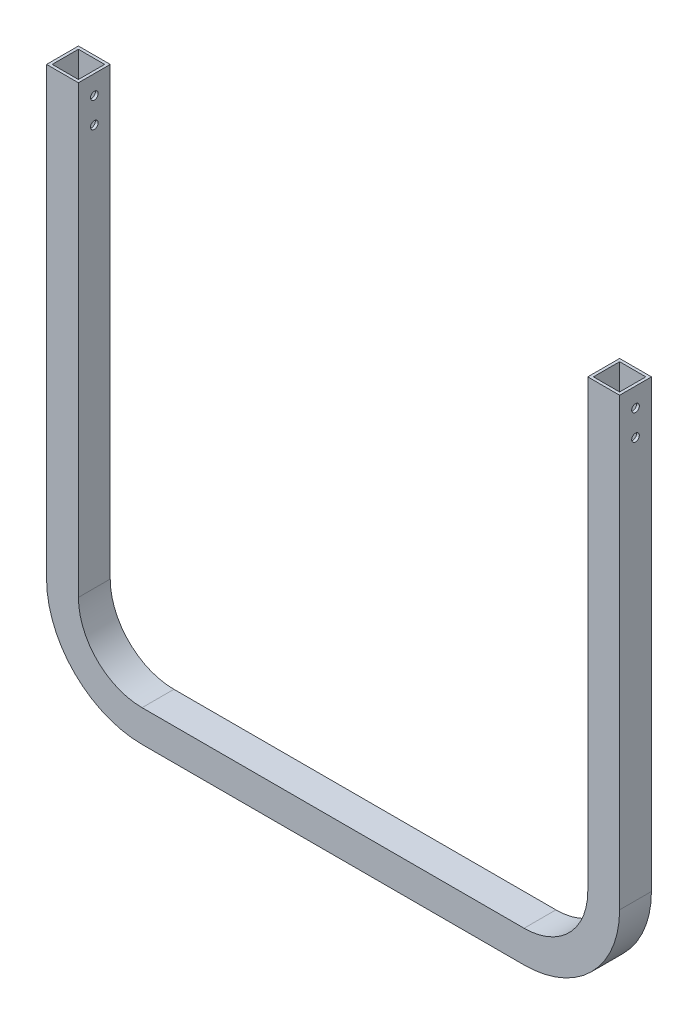
ISO-10303-21;
HEADER;
FILE_DESCRIPTION(('STEP AP214'),'2;1');
FILE_NAME('part.step','',(''),(''),'','','');
FILE_SCHEMA(('AUTOMOTIVE_DESIGN { 1 0 10303 214 1 1 1 1 }'));
ENDSEC;
DATA;
#1=APPLICATION_CONTEXT('core data for automotive mechanical design processes');
#2=APPLICATION_PROTOCOL_DEFINITION('international standard','automotive_design',2000,#1);
#3=PRODUCT_CONTEXT('',#1,'mechanical');
#4=PRODUCT('Part','Part','',(#3));
#5=PRODUCT_RELATED_PRODUCT_CATEGORY('part','',(#4));
#6=PRODUCT_DEFINITION_FORMATION('','',#4);
#7=PRODUCT_DEFINITION_CONTEXT('part definition',#1,'design');
#8=PRODUCT_DEFINITION('design','',#6,#7);
#9=PRODUCT_DEFINITION_SHAPE('','',#8);
#10=(LENGTH_UNIT() NAMED_UNIT(*) SI_UNIT(.MILLI.,.METRE.));
#11=(NAMED_UNIT(*) PLANE_ANGLE_UNIT() SI_UNIT($,.RADIAN.));
#12=(NAMED_UNIT(*) SI_UNIT($,.STERADIAN.) SOLID_ANGLE_UNIT());
#13=UNCERTAINTY_MEASURE_WITH_UNIT(LENGTH_MEASURE(1.E-05),#10,'distance_accuracy_value','');
#14=(GEOMETRIC_REPRESENTATION_CONTEXT(3) GLOBAL_UNCERTAINTY_ASSIGNED_CONTEXT((#13)) GLOBAL_UNIT_ASSIGNED_CONTEXT((#10,
#11,#12)) REPRESENTATION_CONTEXT('',''));
#15=CARTESIAN_POINT('',(0.,0.,0.));
#16=DIRECTION('',(0.,0.,1.));
#17=DIRECTION('',(1.,0.,0.));
#18=AXIS2_PLACEMENT_3D('',#15,#16,#17);
#19=CARTESIAN_POINT('',(-260.935972770029,123.115577889447,25.));
#20=DIRECTION('',(0.,-1.,0.));
#21=DIRECTION('',(0.,0.,-1.));
#22=AXIS2_PLACEMENT_3D('',#19,#20,#21);
#23=PLANE('',#22);
#24=DIRECTION('',(-1.,0.,0.));
#25=VECTOR('',#24,1.);
#26=CARTESIAN_POINT('',(-260.935972770029,123.115577889447,0.));
#27=LINE('',#26,#25);
#28=CARTESIAN_POINT('',(-235.935972770029,123.115577889447,0.));
#29=VERTEX_POINT('',#28);
#30=CARTESIAN_POINT('',(-260.935972770029,123.115577889447,0.));
#31=VERTEX_POINT('',#30);
#32=EDGE_CURVE('E287',#29,#31,#27,.T.);
#33=ORIENTED_EDGE('',*,*,#32,.T.);
#34=DIRECTION('',(0.,0.,-1.));
#35=VECTOR('',#34,1.);
#36=CARTESIAN_POINT('',(-260.935972770029,123.115577889447,25.));
#37=LINE('',#36,#35);
#38=CARTESIAN_POINT('',(-260.935972770029,123.115577889447,25.));
#39=VERTEX_POINT('',#38);
#40=EDGE_CURVE('E11',#39,#31,#37,.T.);
#41=ORIENTED_EDGE('',*,*,#40,.F.);
#42=DIRECTION('',(-1.,0.,0.));
#43=VECTOR('',#42,1.);
#44=CARTESIAN_POINT('',(-260.935972770029,123.115577889447,25.));
#45=LINE('',#44,#43);
#46=CARTESIAN_POINT('',(-235.935972770029,123.115577889447,25.));
#47=VERTEX_POINT('',#46);
#48=EDGE_CURVE('E293',#47,#39,#45,.T.);
#49=ORIENTED_EDGE('',*,*,#48,.F.);
#50=DIRECTION('',(0.,0.,-1.));
#51=VECTOR('',#50,1.);
#52=CARTESIAN_POINT('',(-235.935972770029,123.115577889447,25.));
#53=LINE('',#52,#51);
#54=EDGE_CURVE('E319',#47,#29,#53,.T.);
#55=ORIENTED_EDGE('',*,*,#54,.T.);
#56=EDGE_LOOP('',(#33,#41,#49,#55));
#57=FACE_BOUND('',#56,.T.);
#58=DIRECTION('',(-1.,0.,0.));
#59=VECTOR('',#58,1.);
#60=CARTESIAN_POINT('',(-260.935972770029,123.115577889447,2.2));
#61=LINE('',#60,#59);
#62=CARTESIAN_POINT('',(-238.135972770029,123.115577889447,2.2));
#63=VERTEX_POINT('',#62);
#64=CARTESIAN_POINT('',(-258.735972770029,123.115577889447,2.2));
#65=VERTEX_POINT('',#64);
#66=EDGE_CURVE('E221',#63,#65,#61,.T.);
#67=ORIENTED_EDGE('',*,*,#66,.F.);
#68=DIRECTION('',(0.,0.,-1.));
#69=VECTOR('',#68,1.);
#70=CARTESIAN_POINT('',(-238.135972770029,123.115577889447,25.));
#71=LINE('',#70,#69);
#72=CARTESIAN_POINT('',(-238.135972770029,123.115577889447,22.8));
#73=VERTEX_POINT('',#72);
#74=EDGE_CURVE('E280',#73,#63,#71,.T.);
#75=ORIENTED_EDGE('',*,*,#74,.F.);
#76=DIRECTION('',(-1.,0.,0.));
#77=VECTOR('',#76,1.);
#78=CARTESIAN_POINT('',(-260.935972770029,123.115577889447,22.8));
#79=LINE('',#78,#77);
#80=CARTESIAN_POINT('',(-258.735972770029,123.115577889447,22.8));
#81=VERTEX_POINT('',#80);
#82=EDGE_CURVE('E59',#73,#81,#79,.T.);
#83=ORIENTED_EDGE('',*,*,#82,.T.);
#84=DIRECTION('',(0.,0.,-1.));
#85=VECTOR('',#84,1.);
#86=CARTESIAN_POINT('',(-258.735972770029,123.115577889447,25.));
#87=LINE('',#86,#85);
#88=EDGE_CURVE('E231',#81,#65,#87,.T.);
#89=ORIENTED_EDGE('',*,*,#88,.T.);
#90=EDGE_LOOP('',(#67,#75,#83,#89));
#91=FACE_BOUND('',#90,.T.);
#92=ADVANCED_FACE('F35',(#57,#91),#23,.F.);
#93=CARTESIAN_POINT('',(-260.935972770029,123.115577889447,25.));
#94=DIRECTION('',(1.,0.,0.));
#95=DIRECTION('',(0.,0.,-1.));
#96=AXIS2_PLACEMENT_3D('',#93,#94,#95);
#97=PLANE('',#96);
#98=CARTESIAN_POINT('',(-260.935972770029,108.115577889447,12.5));
#99=DIRECTION('',(-1.,0.,0.));
#100=DIRECTION('',(0.,0.,1.));
#101=AXIS2_PLACEMENT_3D('',#98,#99,#100);
#102=CIRCLE('',#101,3.);
#103=CARTESIAN_POINT('',(-260.935972770029,108.115577889447,15.5));
#104=VERTEX_POINT('',#103);
#105=EDGE_CURVE('E383',#104,#104,#102,.T.);
#106=ORIENTED_EDGE('',*,*,#105,.F.);
#107=EDGE_LOOP('',(#106));
#108=FACE_BOUND('',#107,.T.);
#109=CARTESIAN_POINT('',(-260.935972770029,88.1155778894472,12.5));
#110=DIRECTION('',(-1.,0.,0.));
#111=DIRECTION('',(0.,0.,1.));
#112=AXIS2_PLACEMENT_3D('',#109,#110,#111);
#113=CIRCLE('',#112,3.);
#114=CARTESIAN_POINT('',(-260.935972770029,88.1155778894472,15.5));
#115=VERTEX_POINT('',#114);
#116=EDGE_CURVE('E393',#115,#115,#113,.T.);
#117=ORIENTED_EDGE('',*,*,#116,.F.);
#118=EDGE_LOOP('',(#117));
#119=FACE_BOUND('',#118,.T.);
#120=DIRECTION('',(0.,-1.,0.));
#121=VECTOR('',#120,1.);
#122=CARTESIAN_POINT('',(-260.935972770029,123.115577889447,0.));
#123=LINE('',#122,#121);
#124=CARTESIAN_POINT('',(-260.935972770029,-226.884422110552,0.));
#125=VERTEX_POINT('',#124);
#126=EDGE_CURVE('E322',#31,#125,#123,.T.);
#127=ORIENTED_EDGE('',*,*,#126,.T.);
#128=DIRECTION('',(0.,0.,-1.));
#129=VECTOR('',#128,1.);
#130=CARTESIAN_POINT('',(-260.935972770029,-226.884422110552,25.));
#131=LINE('',#130,#129);
#132=CARTESIAN_POINT('',(-260.935972770029,-226.884422110552,25.));
#133=VERTEX_POINT('',#132);
#134=EDGE_CURVE('E43',#133,#125,#131,.T.);
#135=ORIENTED_EDGE('',*,*,#134,.F.);
#136=DIRECTION('',(0.,-1.,0.));
#137=VECTOR('',#136,1.);
#138=CARTESIAN_POINT('',(-260.935972770029,123.115577889447,25.));
#139=LINE('',#138,#137);
#140=EDGE_CURVE('E296',#39,#133,#139,.T.);
#141=ORIENTED_EDGE('',*,*,#140,.F.);
#142=ORIENTED_EDGE('',*,*,#40,.T.);
#143=EDGE_LOOP('',(#127,#135,#141,#142));
#144=FACE_BOUND('',#143,.T.);
#145=ADVANCED_FACE('F475',(#108,#119,#144),#97,.F.);
#146=CARTESIAN_POINT('',(-185.935972770029,-226.884422110553,25.));
#147=DIRECTION('',(0.,0.,-1.));
#148=DIRECTION('',(-1.,0.,0.));
#149=AXIS2_PLACEMENT_3D('',#146,#147,#148);
#150=CYLINDRICAL_SURFACE('',#149,75.);
#151=CARTESIAN_POINT('',(-185.935972770029,-226.884422110553,0.));
#152=DIRECTION('',(0.,0.,1.));
#153=DIRECTION('',(1.,0.,0.));
#154=AXIS2_PLACEMENT_3D('',#151,#152,#153);
#155=CIRCLE('',#154,75.);
#156=CARTESIAN_POINT('',(-185.935972770028,-301.884422110553,0.));
#157=VERTEX_POINT('',#156);
#158=EDGE_CURVE('E324',#125,#157,#155,.T.);
#159=ORIENTED_EDGE('',*,*,#158,.T.);
#160=DIRECTION('',(0.,0.,-1.));
#161=VECTOR('',#160,1.);
#162=CARTESIAN_POINT('',(-185.935972770028,-301.884422110553,25.));
#163=LINE('',#162,#161);
#164=CARTESIAN_POINT('',(-185.935972770028,-301.884422110553,25.));
#165=VERTEX_POINT('',#164);
#166=EDGE_CURVE('E369',#165,#157,#163,.T.);
#167=ORIENTED_EDGE('',*,*,#166,.F.);
#168=CARTESIAN_POINT('',(-185.935972770029,-226.884422110553,25.));
#169=DIRECTION('',(0.,0.,1.));
#170=DIRECTION('',(1.,0.,0.));
#171=AXIS2_PLACEMENT_3D('',#168,#169,#170);
#172=CIRCLE('',#171,75.);
#173=EDGE_CURVE('E299',#133,#165,#172,.T.);
#174=ORIENTED_EDGE('',*,*,#173,.F.);
#175=ORIENTED_EDGE('',*,*,#134,.T.);
#176=EDGE_LOOP('',(#159,#167,#174,#175));
#177=FACE_BOUND('',#176,.T.);
#178=ADVANCED_FACE('F481',(#177),#150,.T.);
#179=CARTESIAN_POINT('',(-185.935972770028,-301.884422110553,25.));
#180=DIRECTION('',(0.,1.,0.));
#181=DIRECTION('',(0.,0.,1.));
#182=AXIS2_PLACEMENT_3D('',#179,#180,#181);
#183=PLANE('',#182);
#184=DIRECTION('',(1.,0.,0.));
#185=VECTOR('',#184,1.);
#186=CARTESIAN_POINT('',(-185.935972770028,-301.884422110553,0.));
#187=LINE('',#186,#185);
#188=CARTESIAN_POINT('',(114.064027229971,-301.884422110553,0.));
#189=VERTEX_POINT('',#188);
#190=EDGE_CURVE('E326',#157,#189,#187,.T.);
#191=ORIENTED_EDGE('',*,*,#190,.T.);
#192=DIRECTION('',(0.,0.,-1.));
#193=VECTOR('',#192,1.);
#194=CARTESIAN_POINT('',(114.064027229971,-301.884422110553,25.));
#195=LINE('',#194,#193);
#196=CARTESIAN_POINT('',(114.064027229971,-301.884422110553,25.));
#197=VERTEX_POINT('',#196);
#198=EDGE_CURVE('E366',#197,#189,#195,.T.);
#199=ORIENTED_EDGE('',*,*,#198,.F.);
#200=DIRECTION('',(1.,0.,0.));
#201=VECTOR('',#200,1.);
#202=CARTESIAN_POINT('',(-185.935972770028,-301.884422110553,25.));
#203=LINE('',#202,#201);
#204=EDGE_CURVE('E301',#165,#197,#203,.T.);
#205=ORIENTED_EDGE('',*,*,#204,.F.);
#206=ORIENTED_EDGE('',*,*,#166,.T.);
#207=EDGE_LOOP('',(#191,#199,#205,#206));
#208=FACE_BOUND('',#207,.T.);
#209=ADVANCED_FACE('F535',(#208),#183,.F.);
#210=CARTESIAN_POINT('',(114.064027229971,-226.884422110553,25.));
#211=DIRECTION('',(0.,0.,-1.));
#212=DIRECTION('',(-1.,0.,0.));
#213=AXIS2_PLACEMENT_3D('',#210,#211,#212);
#214=CYLINDRICAL_SURFACE('',#213,75.);
#215=CARTESIAN_POINT('',(114.064027229971,-226.884422110553,0.));
#216=DIRECTION('',(0.,0.,1.));
#217=DIRECTION('',(1.,0.,0.));
#218=AXIS2_PLACEMENT_3D('',#215,#216,#217);
#219=CIRCLE('',#218,75.);
#220=CARTESIAN_POINT('',(189.064027229971,-226.884422110552,0.));
#221=VERTEX_POINT('',#220);
#222=EDGE_CURVE('E328',#189,#221,#219,.T.);
#223=ORIENTED_EDGE('',*,*,#222,.T.);
#224=DIRECTION('',(0.,0.,-1.));
#225=VECTOR('',#224,1.);
#226=CARTESIAN_POINT('',(189.064027229971,-226.884422110552,25.));
#227=LINE('',#226,#225);
#228=CARTESIAN_POINT('',(189.064027229971,-226.884422110552,25.));
#229=VERTEX_POINT('',#228);
#230=EDGE_CURVE('E363',#229,#221,#227,.T.);
#231=ORIENTED_EDGE('',*,*,#230,.F.);
#232=CARTESIAN_POINT('',(114.064027229971,-226.884422110553,25.));
#233=DIRECTION('',(0.,0.,1.));
#234=DIRECTION('',(1.,0.,0.));
#235=AXIS2_PLACEMENT_3D('',#232,#233,#234);
#236=CIRCLE('',#235,75.);
#237=EDGE_CURVE('E303',#197,#229,#236,.T.);
#238=ORIENTED_EDGE('',*,*,#237,.F.);
#239=ORIENTED_EDGE('',*,*,#198,.T.);
#240=EDGE_LOOP('',(#223,#231,#238,#239));
#241=FACE_BOUND('',#240,.T.);
#242=ADVANCED_FACE('F532',(#241),#214,.T.);
#243=CARTESIAN_POINT('',(189.064027229971,123.115577889447,25.));
#244=DIRECTION('',(-1.,0.,0.));
#245=DIRECTION('',(0.,-1.,0.));
#246=AXIS2_PLACEMENT_3D('',#243,#244,#245);
#247=PLANE('',#246);
#248=CARTESIAN_POINT('',(189.064027229971,108.115577889447,12.5));
#249=DIRECTION('',(-1.,0.,0.));
#250=DIRECTION('',(0.,0.,1.));
#251=AXIS2_PLACEMENT_3D('',#248,#249,#250);
#252=CIRCLE('',#251,3.);
#253=CARTESIAN_POINT('',(189.064027229971,108.115577889447,15.5));
#254=VERTEX_POINT('',#253);
#255=EDGE_CURVE('E376',#254,#254,#252,.T.);
#256=ORIENTED_EDGE('',*,*,#255,.T.);
#257=EDGE_LOOP('',(#256));
#258=FACE_BOUND('',#257,.T.);
#259=CARTESIAN_POINT('',(189.064027229971,88.1155778894472,12.5));
#260=DIRECTION('',(-1.,0.,0.));
#261=DIRECTION('',(0.,0.,1.));
#262=AXIS2_PLACEMENT_3D('',#259,#260,#261);
#263=CIRCLE('',#262,3.);
#264=CARTESIAN_POINT('',(189.064027229971,88.1155778894472,15.5));
#265=VERTEX_POINT('',#264);
#266=EDGE_CURVE('E388',#265,#265,#263,.T.);
#267=ORIENTED_EDGE('',*,*,#266,.T.);
#268=EDGE_LOOP('',(#267));
#269=FACE_BOUND('',#268,.T.);
#270=DIRECTION('',(0.,1.,0.));
#271=VECTOR('',#270,1.);
#272=CARTESIAN_POINT('',(189.064027229971,123.115577889447,0.));
#273=LINE('',#272,#271);
#274=CARTESIAN_POINT('',(189.064027229971,123.115577889447,0.));
#275=VERTEX_POINT('',#274);
#276=EDGE_CURVE('E330',#221,#275,#273,.T.);
#277=ORIENTED_EDGE('',*,*,#276,.T.);
#278=DIRECTION('',(0.,0.,-1.));
#279=VECTOR('',#278,1.);
#280=CARTESIAN_POINT('',(189.064027229971,123.115577889447,25.));
#281=LINE('',#280,#279);
#282=CARTESIAN_POINT('',(189.064027229971,123.115577889447,25.));
#283=VERTEX_POINT('',#282);
#284=EDGE_CURVE('E360',#283,#275,#281,.T.);
#285=ORIENTED_EDGE('',*,*,#284,.F.);
#286=DIRECTION('',(0.,1.,0.));
#287=VECTOR('',#286,1.);
#288=CARTESIAN_POINT('',(189.064027229971,123.115577889447,25.));
#289=LINE('',#288,#287);
#290=EDGE_CURVE('E305',#229,#283,#289,.T.);
#291=ORIENTED_EDGE('',*,*,#290,.F.);
#292=ORIENTED_EDGE('',*,*,#230,.T.);
#293=EDGE_LOOP('',(#277,#285,#291,#292));
#294=FACE_BOUND('',#293,.T.);
#295=ADVANCED_FACE('F528',(#258,#269,#294),#247,.F.);
#296=CARTESIAN_POINT('',(164.064027229971,123.115577889447,25.));
#297=DIRECTION('',(0.,-1.,0.));
#298=DIRECTION('',(0.,0.,-1.));
#299=AXIS2_PLACEMENT_3D('',#296,#297,#298);
#300=PLANE('',#299);
#301=DIRECTION('',(0.,0.,1.));
#302=VECTOR('',#301,1.);
#303=CARTESIAN_POINT('',(166.264027229971,123.115577889447,2.2));
#304=LINE('',#303,#302);
#305=CARTESIAN_POINT('',(166.264027229971,123.115577889447,2.2));
#306=VERTEX_POINT('',#305);
#307=CARTESIAN_POINT('',(166.264027229971,123.115577889447,22.8));
#308=VERTEX_POINT('',#307);
#309=EDGE_CURVE('E210',#306,#308,#304,.T.);
#310=ORIENTED_EDGE('',*,*,#309,.F.);
#311=DIRECTION('',(-1.,0.,0.));
#312=VECTOR('',#311,1.);
#313=CARTESIAN_POINT('',(166.264027229971,123.115577889447,2.2));
#314=LINE('',#313,#312);
#315=CARTESIAN_POINT('',(186.864027229971,123.115577889447,2.2));
#316=VERTEX_POINT('',#315);
#317=EDGE_CURVE('E214',#316,#306,#314,.T.);
#318=ORIENTED_EDGE('',*,*,#317,.F.);
#319=DIRECTION('',(0.,0.,-1.));
#320=VECTOR('',#319,1.);
#321=CARTESIAN_POINT('',(186.864027229971,123.115577889447,2.2));
#322=LINE('',#321,#320);
#323=CARTESIAN_POINT('',(186.864027229971,123.115577889447,22.8));
#324=VERTEX_POINT('',#323);
#325=EDGE_CURVE('E219',#324,#316,#322,.T.);
#326=ORIENTED_EDGE('',*,*,#325,.F.);
#327=DIRECTION('',(1.,0.,0.));
#328=VECTOR('',#327,1.);
#329=CARTESIAN_POINT('',(166.264027229971,123.115577889447,22.8));
#330=LINE('',#329,#328);
#331=EDGE_CURVE('E202',#308,#324,#330,.T.);
#332=ORIENTED_EDGE('',*,*,#331,.F.);
#333=EDGE_LOOP('',(#310,#318,#326,#332));
#334=FACE_BOUND('',#333,.T.);
#335=DIRECTION('',(-1.,0.,0.));
#336=VECTOR('',#335,1.);
#337=CARTESIAN_POINT('',(164.064027229971,123.115577889447,0.));
#338=LINE('',#337,#336);
#339=CARTESIAN_POINT('',(164.064027229971,123.115577889447,0.));
#340=VERTEX_POINT('',#339);
#341=EDGE_CURVE('E332',#275,#340,#338,.T.);
#342=ORIENTED_EDGE('',*,*,#341,.T.);
#343=DIRECTION('',(0.,0.,-1.));
#344=VECTOR('',#343,1.);
#345=CARTESIAN_POINT('',(164.064027229971,123.115577889447,25.));
#346=LINE('',#345,#344);
#347=CARTESIAN_POINT('',(164.064027229971,123.115577889447,25.));
#348=VERTEX_POINT('',#347);
#349=EDGE_CURVE('E357',#348,#340,#346,.T.);
#350=ORIENTED_EDGE('',*,*,#349,.F.);
#351=DIRECTION('',(-1.,0.,0.));
#352=VECTOR('',#351,1.);
#353=CARTESIAN_POINT('',(164.064027229971,123.115577889447,25.));
#354=LINE('',#353,#352);
#355=EDGE_CURVE('E307',#283,#348,#354,.T.);
#356=ORIENTED_EDGE('',*,*,#355,.F.);
#357=ORIENTED_EDGE('',*,*,#284,.T.);
#358=EDGE_LOOP('',(#342,#350,#356,#357));
#359=FACE_BOUND('',#358,.T.);
#360=ADVANCED_FACE('F216',(#334,#359),#300,.F.);
#361=CARTESIAN_POINT('',(164.064027229971,123.115577889447,25.));
#362=DIRECTION('',(1.,0.,0.));
#363=DIRECTION('',(0.,1.,0.));
#364=AXIS2_PLACEMENT_3D('',#361,#362,#363);
#365=PLANE('',#364);
#366=CARTESIAN_POINT('',(164.064027229971,108.115577889447,12.5));
#367=DIRECTION('',(1.,0.,0.));
#368=DIRECTION('',(0.,1.,0.));
#369=AXIS2_PLACEMENT_3D('',#366,#367,#368);
#370=CIRCLE('',#369,3.);
#371=CARTESIAN_POINT('',(164.064027229971,111.115577889447,12.5));
#372=VERTEX_POINT('',#371);
#373=EDGE_CURVE('E419',#372,#372,#370,.T.);
#374=ORIENTED_EDGE('',*,*,#373,.T.);
#375=EDGE_LOOP('',(#374));
#376=FACE_BOUND('',#375,.T.);
#377=CARTESIAN_POINT('',(164.064027229971,88.1155778894472,12.5));
#378=DIRECTION('',(1.,0.,0.));
#379=DIRECTION('',(0.,1.,0.));
#380=AXIS2_PLACEMENT_3D('',#377,#378,#379);
#381=CIRCLE('',#380,3.);
#382=CARTESIAN_POINT('',(164.064027229971,91.1155778894472,12.5));
#383=VERTEX_POINT('',#382);
#384=EDGE_CURVE('E404',#383,#383,#381,.T.);
#385=ORIENTED_EDGE('',*,*,#384,.T.);
#386=EDGE_LOOP('',(#385));
#387=FACE_BOUND('',#386,.T.);
#388=DIRECTION('',(0.,-1.,0.));
#389=VECTOR('',#388,1.);
#390=CARTESIAN_POINT('',(164.064027229971,123.115577889447,0.));
#391=LINE('',#390,#389);
#392=CARTESIAN_POINT('',(164.064027229971,-226.884422110553,0.));
#393=VERTEX_POINT('',#392);
#394=EDGE_CURVE('E334',#340,#393,#391,.T.);
#395=ORIENTED_EDGE('',*,*,#394,.T.);
#396=DIRECTION('',(0.,0.,-1.));
#397=VECTOR('',#396,1.);
#398=CARTESIAN_POINT('',(164.064027229971,-226.884422110553,25.));
#399=LINE('',#398,#397);
#400=CARTESIAN_POINT('',(164.064027229971,-226.884422110553,25.));
#401=VERTEX_POINT('',#400);
#402=EDGE_CURVE('E354',#401,#393,#399,.T.);
#403=ORIENTED_EDGE('',*,*,#402,.F.);
#404=DIRECTION('',(0.,-1.,0.));
#405=VECTOR('',#404,1.);
#406=CARTESIAN_POINT('',(164.064027229971,123.115577889447,25.));
#407=LINE('',#406,#405);
#408=EDGE_CURVE('E309',#348,#401,#407,.T.);
#409=ORIENTED_EDGE('',*,*,#408,.F.);
#410=ORIENTED_EDGE('',*,*,#349,.T.);
#411=EDGE_LOOP('',(#395,#403,#409,#410));
#412=FACE_BOUND('',#411,.T.);
#413=ADVANCED_FACE('F519',(#376,#387,#412),#365,.F.);
#414=CARTESIAN_POINT('',(114.064027229971,-226.884422110553,25.));
#415=DIRECTION('',(0.,0.,-1.));
#416=DIRECTION('',(-1.,0.,0.));
#417=AXIS2_PLACEMENT_3D('',#414,#415,#416);
#418=CYLINDRICAL_SURFACE('',#417,50.);
#419=CARTESIAN_POINT('',(114.064027229971,-226.884422110553,0.));
#420=DIRECTION('',(0.,0.,-1.));
#421=DIRECTION('',(1.,0.,0.));
#422=AXIS2_PLACEMENT_3D('',#419,#420,#421);
#423=CIRCLE('',#422,50.);
#424=CARTESIAN_POINT('',(114.064027229971,-276.884422110553,0.));
#425=VERTEX_POINT('',#424);
#426=EDGE_CURVE('E336',#393,#425,#423,.T.);
#427=ORIENTED_EDGE('',*,*,#426,.T.);
#428=DIRECTION('',(0.,0.,-1.));
#429=VECTOR('',#428,1.);
#430=CARTESIAN_POINT('',(114.064027229971,-276.884422110553,25.));
#431=LINE('',#430,#429);
#432=CARTESIAN_POINT('',(114.064027229971,-276.884422110553,25.));
#433=VERTEX_POINT('',#432);
#434=EDGE_CURVE('E351',#433,#425,#431,.T.);
#435=ORIENTED_EDGE('',*,*,#434,.F.);
#436=CARTESIAN_POINT('',(114.064027229971,-226.884422110553,25.));
#437=DIRECTION('',(0.,0.,-1.));
#438=DIRECTION('',(1.,0.,0.));
#439=AXIS2_PLACEMENT_3D('',#436,#437,#438);
#440=CIRCLE('',#439,50.);
#441=EDGE_CURVE('E311',#401,#433,#440,.T.);
#442=ORIENTED_EDGE('',*,*,#441,.F.);
#443=ORIENTED_EDGE('',*,*,#402,.T.);
#444=EDGE_LOOP('',(#427,#435,#442,#443));
#445=FACE_BOUND('',#444,.T.);
#446=ADVANCED_FACE('F515',(#445),#418,.F.);
#447=CARTESIAN_POINT('',(-185.935972770028,-276.884422110553,25.));
#448=DIRECTION('',(0.,-1.,0.));
#449=DIRECTION('',(0.,0.,-1.));
#450=AXIS2_PLACEMENT_3D('',#447,#448,#449);
#451=PLANE('',#450);
#452=DIRECTION('',(-1.,0.,0.));
#453=VECTOR('',#452,1.);
#454=CARTESIAN_POINT('',(-185.935972770028,-276.884422110553,0.));
#455=LINE('',#454,#453);
#456=CARTESIAN_POINT('',(-185.935972770028,-276.884422110553,0.));
#457=VERTEX_POINT('',#456);
#458=EDGE_CURVE('E338',#425,#457,#455,.T.);
#459=ORIENTED_EDGE('',*,*,#458,.T.);
#460=DIRECTION('',(0.,0.,-1.));
#461=VECTOR('',#460,1.);
#462=CARTESIAN_POINT('',(-185.935972770028,-276.884422110553,25.));
#463=LINE('',#462,#461);
#464=CARTESIAN_POINT('',(-185.935972770028,-276.884422110553,25.));
#465=VERTEX_POINT('',#464);
#466=EDGE_CURVE('E348',#465,#457,#463,.T.);
#467=ORIENTED_EDGE('',*,*,#466,.F.);
#468=DIRECTION('',(-1.,0.,0.));
#469=VECTOR('',#468,1.);
#470=CARTESIAN_POINT('',(-185.935972770028,-276.884422110553,25.));
#471=LINE('',#470,#469);
#472=EDGE_CURVE('E313',#433,#465,#471,.T.);
#473=ORIENTED_EDGE('',*,*,#472,.F.);
#474=ORIENTED_EDGE('',*,*,#434,.T.);
#475=EDGE_LOOP('',(#459,#467,#473,#474));
#476=FACE_BOUND('',#475,.T.);
#477=ADVANCED_FACE('F510',(#476),#451,.F.);
#478=CARTESIAN_POINT('',(-185.935972770029,-226.884422110553,25.));
#479=DIRECTION('',(0.,0.,-1.));
#480=DIRECTION('',(-1.,0.,0.));
#481=AXIS2_PLACEMENT_3D('',#478,#479,#480);
#482=CYLINDRICAL_SURFACE('',#481,50.);
#483=CARTESIAN_POINT('',(-185.935972770029,-226.884422110553,0.));
#484=DIRECTION('',(0.,0.,-1.));
#485=DIRECTION('',(1.,0.,0.));
#486=AXIS2_PLACEMENT_3D('',#483,#484,#485);
#487=CIRCLE('',#486,50.);
#488=CARTESIAN_POINT('',(-235.935972770029,-226.884422110552,0.));
#489=VERTEX_POINT('',#488);
#490=EDGE_CURVE('E340',#457,#489,#487,.T.);
#491=ORIENTED_EDGE('',*,*,#490,.T.);
#492=DIRECTION('',(0.,0.,-1.));
#493=VECTOR('',#492,1.);
#494=CARTESIAN_POINT('',(-235.935972770029,-226.884422110552,25.));
#495=LINE('',#494,#493);
#496=CARTESIAN_POINT('',(-235.935972770029,-226.884422110552,25.));
#497=VERTEX_POINT('',#496);
#498=EDGE_CURVE('E345',#497,#489,#495,.T.);
#499=ORIENTED_EDGE('',*,*,#498,.F.);
#500=CARTESIAN_POINT('',(-185.935972770029,-226.884422110553,25.));
#501=DIRECTION('',(0.,0.,-1.));
#502=DIRECTION('',(1.,0.,0.));
#503=AXIS2_PLACEMENT_3D('',#500,#501,#502);
#504=CIRCLE('',#503,50.);
#505=EDGE_CURVE('E315',#465,#497,#504,.T.);
#506=ORIENTED_EDGE('',*,*,#505,.F.);
#507=ORIENTED_EDGE('',*,*,#466,.T.);
#508=EDGE_LOOP('',(#491,#499,#506,#507));
#509=FACE_BOUND('',#508,.T.);
#510=ADVANCED_FACE('F504',(#509),#482,.F.);
#511=CARTESIAN_POINT('',(-235.935972770029,123.115577889447,25.));
#512=DIRECTION('',(-1.,0.,0.));
#513=DIRECTION('',(0.,-1.,0.));
#514=AXIS2_PLACEMENT_3D('',#511,#512,#513);
#515=PLANE('',#514);
#516=CARTESIAN_POINT('',(-235.935972770029,108.115577889447,12.5));
#517=DIRECTION('',(-1.,0.,0.));
#518=DIRECTION('',(0.,-1.,0.));
#519=AXIS2_PLACEMENT_3D('',#516,#517,#518);
#520=CIRCLE('',#519,3.);
#521=CARTESIAN_POINT('',(-235.935972770029,105.115577889447,12.5));
#522=VERTEX_POINT('',#521);
#523=EDGE_CURVE('E416',#522,#522,#520,.T.);
#524=ORIENTED_EDGE('',*,*,#523,.T.);
#525=EDGE_LOOP('',(#524));
#526=FACE_BOUND('',#525,.T.);
#527=CARTESIAN_POINT('',(-235.935972770029,88.1155778894472,12.5));
#528=DIRECTION('',(-1.,0.,0.));
#529=DIRECTION('',(0.,-1.,0.));
#530=AXIS2_PLACEMENT_3D('',#527,#528,#529);
#531=CIRCLE('',#530,3.);
#532=CARTESIAN_POINT('',(-235.935972770029,85.1155778894472,12.5));
#533=VERTEX_POINT('',#532);
#534=EDGE_CURVE('E401',#533,#533,#531,.T.);
#535=ORIENTED_EDGE('',*,*,#534,.T.);
#536=EDGE_LOOP('',(#535));
#537=FACE_BOUND('',#536,.T.);
#538=DIRECTION('',(0.,1.,0.));
#539=VECTOR('',#538,1.);
#540=CARTESIAN_POINT('',(-235.935972770029,123.115577889447,0.));
#541=LINE('',#540,#539);
#542=EDGE_CURVE('E297',#489,#29,#541,.T.);
#543=ORIENTED_EDGE('',*,*,#542,.T.);
#544=ORIENTED_EDGE('',*,*,#54,.F.);
#545=DIRECTION('',(0.,1.,0.));
#546=VECTOR('',#545,1.);
#547=CARTESIAN_POINT('',(-235.935972770029,123.115577889447,25.));
#548=LINE('',#547,#546);
#549=EDGE_CURVE('E317',#497,#47,#548,.T.);
#550=ORIENTED_EDGE('',*,*,#549,.F.);
#551=ORIENTED_EDGE('',*,*,#498,.T.);
#552=EDGE_LOOP('',(#543,#544,#550,#551));
#553=FACE_BOUND('',#552,.T.);
#554=ADVANCED_FACE('F502',(#526,#537,#553),#515,.F.);
#555=CARTESIAN_POINT('',(-185.935972770029,-226.884422110553,25.));
#556=DIRECTION('',(0.,0.,1.));
#557=DIRECTION('',(1.,0.,0.));
#558=AXIS2_PLACEMENT_3D('',#555,#556,#557);
#559=PLANE('',#558);
#560=ORIENTED_EDGE('',*,*,#48,.T.);
#561=ORIENTED_EDGE('',*,*,#140,.T.);
#562=ORIENTED_EDGE('',*,*,#173,.T.);
#563=ORIENTED_EDGE('',*,*,#204,.T.);
#564=ORIENTED_EDGE('',*,*,#237,.T.);
#565=ORIENTED_EDGE('',*,*,#290,.T.);
#566=ORIENTED_EDGE('',*,*,#355,.T.);
#567=ORIENTED_EDGE('',*,*,#408,.T.);
#568=ORIENTED_EDGE('',*,*,#441,.T.);
#569=ORIENTED_EDGE('',*,*,#472,.T.);
#570=ORIENTED_EDGE('',*,*,#505,.T.);
#571=ORIENTED_EDGE('',*,*,#549,.T.);
#572=EDGE_LOOP('',(#560,#561,#562,#563,#564,#565,#566,#567,#568,#569,#570,#571));
#573=FACE_BOUND('',#572,.T.);
#574=ADVANCED_FACE('F497',(#573),#559,.T.);
#575=CARTESIAN_POINT('',(-185.935972770029,-226.884422110553,0.));
#576=DIRECTION('',(0.,0.,1.));
#577=DIRECTION('',(1.,0.,0.));
#578=AXIS2_PLACEMENT_3D('',#575,#576,#577);
#579=PLANE('',#578);
#580=ORIENTED_EDGE('',*,*,#32,.F.);
#581=ORIENTED_EDGE('',*,*,#542,.F.);
#582=ORIENTED_EDGE('',*,*,#490,.F.);
#583=ORIENTED_EDGE('',*,*,#458,.F.);
#584=ORIENTED_EDGE('',*,*,#426,.F.);
#585=ORIENTED_EDGE('',*,*,#394,.F.);
#586=ORIENTED_EDGE('',*,*,#341,.F.);
#587=ORIENTED_EDGE('',*,*,#276,.F.);
#588=ORIENTED_EDGE('',*,*,#222,.F.);
#589=ORIENTED_EDGE('',*,*,#190,.F.);
#590=ORIENTED_EDGE('',*,*,#158,.F.);
#591=ORIENTED_EDGE('',*,*,#126,.F.);
#592=EDGE_LOOP('',(#580,#581,#582,#583,#584,#585,#586,#587,#588,#589,#590,#591));
#593=FACE_BOUND('',#592,.T.);
#594=ADVANCED_FACE('F489',(#593),#579,.F.);
#595=CARTESIAN_POINT('',(-258.735972770029,123.115577889447,25.));
#596=DIRECTION('',(1.,0.,0.));
#597=DIRECTION('',(0.,0.,-1.));
#598=AXIS2_PLACEMENT_3D('',#595,#596,#597);
#599=PLANE('',#598);
#600=CARTESIAN_POINT('',(-258.735972770029,108.115577889447,12.5));
#601=DIRECTION('',(1.,0.,0.));
#602=DIRECTION('',(0.,0.,-1.));
#603=AXIS2_PLACEMENT_3D('',#600,#601,#602);
#604=CIRCLE('',#603,3.);
#605=CARTESIAN_POINT('',(-258.735972770029,108.115577889447,9.5));
#606=VERTEX_POINT('',#605);
#607=EDGE_CURVE('E413',#606,#606,#604,.T.);
#608=ORIENTED_EDGE('',*,*,#607,.F.);
#609=EDGE_LOOP('',(#608));
#610=FACE_BOUND('',#609,.T.);
#611=CARTESIAN_POINT('',(-258.735972770029,88.1155778894472,12.5));
#612=DIRECTION('',(1.,0.,0.));
#613=DIRECTION('',(0.,0.,-1.));
#614=AXIS2_PLACEMENT_3D('',#611,#612,#613);
#615=CIRCLE('',#614,3.);
#616=CARTESIAN_POINT('',(-258.735972770029,88.1155778894472,9.50000000000001));
#617=VERTEX_POINT('',#616);
#618=EDGE_CURVE('E398',#617,#617,#615,.T.);
#619=ORIENTED_EDGE('',*,*,#618,.F.);
#620=EDGE_LOOP('',(#619));
#621=FACE_BOUND('',#620,.T.);
#622=DIRECTION('',(0.,-1.,0.));
#623=VECTOR('',#622,1.);
#624=CARTESIAN_POINT('',(-258.735972770029,123.115577889447,2.2));
#625=LINE('',#624,#623);
#626=CARTESIAN_POINT('',(-258.735972770029,-226.884422110552,2.2));
#627=VERTEX_POINT('',#626);
#628=EDGE_CURVE('E225',#65,#627,#625,.T.);
#629=ORIENTED_EDGE('',*,*,#628,.F.);
#630=ORIENTED_EDGE('',*,*,#88,.F.);
#631=DIRECTION('',(0.,-1.,0.));
#632=VECTOR('',#631,1.);
#633=CARTESIAN_POINT('',(-258.735972770029,123.115577889447,22.8));
#634=LINE('',#633,#632);
#635=CARTESIAN_POINT('',(-258.735972770029,-226.884422110552,22.8));
#636=VERTEX_POINT('',#635);
#637=EDGE_CURVE('E233',#81,#636,#634,.T.);
#638=ORIENTED_EDGE('',*,*,#637,.T.);
#639=DIRECTION('',(0.,0.,-1.));
#640=VECTOR('',#639,1.);
#641=CARTESIAN_POINT('',(-258.735972770029,-226.884422110552,25.));
#642=LINE('',#641,#640);
#643=EDGE_CURVE('E228',#636,#627,#642,.T.);
#644=ORIENTED_EDGE('',*,*,#643,.T.);
#645=EDGE_LOOP('',(#629,#630,#638,#644));
#646=FACE_BOUND('',#645,.T.);
#647=ADVANCED_FACE('F444',(#610,#621,#646),#599,.T.);
#648=CARTESIAN_POINT('',(-185.935972770029,-226.884422110553,25.));
#649=DIRECTION('',(0.,0.,-1.));
#650=DIRECTION('',(-1.,0.,0.));
#651=AXIS2_PLACEMENT_3D('',#648,#649,#650);
#652=CYLINDRICAL_SURFACE('',#651,72.8);
#653=CARTESIAN_POINT('',(-185.935972770029,-226.884422110553,2.2));
#654=DIRECTION('',(0.,0.,1.));
#655=DIRECTION('',(1.,0.,0.));
#656=AXIS2_PLACEMENT_3D('',#653,#654,#655);
#657=CIRCLE('',#656,72.8);
#658=CARTESIAN_POINT('',(-185.935972770028,-299.684422110553,2.2));
#659=VERTEX_POINT('',#658);
#660=EDGE_CURVE('E227',#627,#659,#657,.T.);
#661=ORIENTED_EDGE('',*,*,#660,.F.);
#662=ORIENTED_EDGE('',*,*,#643,.F.);
#663=CARTESIAN_POINT('',(-185.935972770029,-226.884422110553,22.8));
#664=DIRECTION('',(0.,0.,1.));
#665=DIRECTION('',(1.,0.,0.));
#666=AXIS2_PLACEMENT_3D('',#663,#664,#665);
#667=CIRCLE('',#666,72.8);
#668=CARTESIAN_POINT('',(-185.935972770028,-299.684422110553,22.8));
#669=VERTEX_POINT('',#668);
#670=EDGE_CURVE('E235',#636,#669,#667,.T.);
#671=ORIENTED_EDGE('',*,*,#670,.T.);
#672=DIRECTION('',(0.,0.,1.));
#673=VECTOR('',#672,1.);
#674=CARTESIAN_POINT('',(-185.935972770028,-299.684422110553,25.));
#675=LINE('',#674,#673);
#676=EDGE_CURVE('E232',#669,#659,#675,.F.);
#677=ORIENTED_EDGE('',*,*,#676,.T.);
#678=EDGE_LOOP('',(#661,#662,#671,#677));
#679=FACE_BOUND('',#678,.T.);
#680=ADVANCED_FACE('F440',(#679),#652,.F.);
#681=CARTESIAN_POINT('',(-185.935972770028,-299.684422110553,25.));
#682=DIRECTION('',(0.,1.,0.));
#683=DIRECTION('',(0.,0.,1.));
#684=AXIS2_PLACEMENT_3D('',#681,#682,#683);
#685=PLANE('',#684);
#686=DIRECTION('',(1.,0.,0.));
#687=VECTOR('',#686,1.);
#688=CARTESIAN_POINT('',(-185.935972770028,-299.684422110553,2.2));
#689=LINE('',#688,#687);
#690=CARTESIAN_POINT('',(114.064027229971,-299.684422110553,2.2));
#691=VERTEX_POINT('',#690);
#692=EDGE_CURVE('E237',#659,#691,#689,.T.);
#693=ORIENTED_EDGE('',*,*,#692,.F.);
#694=ORIENTED_EDGE('',*,*,#676,.F.);
#695=DIRECTION('',(1.,0.,0.));
#696=VECTOR('',#695,1.);
#697=CARTESIAN_POINT('',(-185.935972770028,-299.684422110553,22.8));
#698=LINE('',#697,#696);
#699=CARTESIAN_POINT('',(114.064027229971,-299.684422110553,22.8));
#700=VERTEX_POINT('',#699);
#701=EDGE_CURVE('E242',#669,#700,#698,.T.);
#702=ORIENTED_EDGE('',*,*,#701,.T.);
#703=DIRECTION('',(0.,0.,-1.));
#704=VECTOR('',#703,1.);
#705=CARTESIAN_POINT('',(114.064027229971,-299.684422110553,25.));
#706=LINE('',#705,#704);
#707=EDGE_CURVE('E240',#700,#691,#706,.T.);
#708=ORIENTED_EDGE('',*,*,#707,.T.);
#709=EDGE_LOOP('',(#693,#694,#702,#708));
#710=FACE_BOUND('',#709,.T.);
#711=ADVANCED_FACE('F436',(#710),#685,.T.);
#712=CARTESIAN_POINT('',(114.064027229971,-226.884422110553,25.));
#713=DIRECTION('',(0.,0.,-1.));
#714=DIRECTION('',(-1.,0.,0.));
#715=AXIS2_PLACEMENT_3D('',#712,#713,#714);
#716=CYLINDRICAL_SURFACE('',#715,72.8);
#717=CARTESIAN_POINT('',(114.064027229971,-226.884422110553,2.2));
#718=DIRECTION('',(0.,0.,1.));
#719=DIRECTION('',(1.,0.,0.));
#720=AXIS2_PLACEMENT_3D('',#717,#718,#719);
#721=CIRCLE('',#720,72.8);
#722=CARTESIAN_POINT('',(186.864027229971,-226.884422110552,2.2));
#723=VERTEX_POINT('',#722);
#724=EDGE_CURVE('E244',#691,#723,#721,.T.);
#725=ORIENTED_EDGE('',*,*,#724,.F.);
#726=ORIENTED_EDGE('',*,*,#707,.F.);
#727=CARTESIAN_POINT('',(114.064027229971,-226.884422110553,22.8));
#728=DIRECTION('',(0.,0.,1.));
#729=DIRECTION('',(1.,0.,0.));
#730=AXIS2_PLACEMENT_3D('',#727,#728,#729);
#731=CIRCLE('',#730,72.8);
#732=CARTESIAN_POINT('',(186.864027229971,-226.884422110552,22.8));
#733=VERTEX_POINT('',#732);
#734=EDGE_CURVE('E249',#700,#733,#731,.T.);
#735=ORIENTED_EDGE('',*,*,#734,.T.);
#736=DIRECTION('',(0.,0.,1.));
#737=VECTOR('',#736,1.);
#738=CARTESIAN_POINT('',(186.864027229971,-226.884422110552,25.));
#739=LINE('',#738,#737);
#740=EDGE_CURVE('E247',#733,#723,#739,.F.);
#741=ORIENTED_EDGE('',*,*,#740,.T.);
#742=EDGE_LOOP('',(#725,#726,#735,#741));
#743=FACE_BOUND('',#742,.T.);
#744=ADVANCED_FACE('F433',(#743),#716,.F.);
#745=CARTESIAN_POINT('',(186.864027229971,123.115577889447,25.));
#746=DIRECTION('',(-1.,0.,0.));
#747=DIRECTION('',(0.,-1.,0.));
#748=AXIS2_PLACEMENT_3D('',#745,#746,#747);
#749=PLANE('',#748);
#750=CARTESIAN_POINT('',(186.864027229971,108.115577889447,12.5));
#751=DIRECTION('',(-1.,0.,0.));
#752=DIRECTION('',(0.,-1.,0.));
#753=AXIS2_PLACEMENT_3D('',#750,#751,#752);
#754=CIRCLE('',#753,3.);
#755=CARTESIAN_POINT('',(186.864027229971,105.115577889447,12.5));
#756=VERTEX_POINT('',#755);
#757=EDGE_CURVE('E410',#756,#756,#754,.T.);
#758=ORIENTED_EDGE('',*,*,#757,.F.);
#759=EDGE_LOOP('',(#758));
#760=FACE_BOUND('',#759,.T.);
#761=CARTESIAN_POINT('',(186.864027229971,88.1155778894472,12.5));
#762=DIRECTION('',(-1.,0.,0.));
#763=DIRECTION('',(0.,-1.,0.));
#764=AXIS2_PLACEMENT_3D('',#761,#762,#763);
#765=CIRCLE('',#764,3.);
#766=CARTESIAN_POINT('',(186.864027229971,85.1155778894472,12.5));
#767=VERTEX_POINT('',#766);
#768=EDGE_CURVE('E380',#767,#767,#765,.T.);
#769=ORIENTED_EDGE('',*,*,#768,.F.);
#770=EDGE_LOOP('',(#769));
#771=FACE_BOUND('',#770,.T.);
#772=DIRECTION('',(0.,1.,0.));
#773=VECTOR('',#772,1.);
#774=CARTESIAN_POINT('',(186.864027229971,123.115577889447,22.8));
#775=LINE('',#774,#773);
#776=EDGE_CURVE('E207',#733,#324,#775,.T.);
#777=ORIENTED_EDGE('',*,*,#776,.T.);
#778=ORIENTED_EDGE('',*,*,#325,.T.);
#779=DIRECTION('',(0.,1.,0.));
#780=VECTOR('',#779,1.);
#781=CARTESIAN_POINT('',(186.864027229971,123.115577889447,2.2));
#782=LINE('',#781,#780);
#783=EDGE_CURVE('E251',#723,#316,#782,.T.);
#784=ORIENTED_EDGE('',*,*,#783,.F.);
#785=ORIENTED_EDGE('',*,*,#740,.F.);
#786=EDGE_LOOP('',(#777,#778,#784,#785));
#787=FACE_BOUND('',#786,.T.);
#788=ADVANCED_FACE('F427',(#760,#771,#787),#749,.T.);
#789=CARTESIAN_POINT('',(166.264027229971,123.115577889447,25.));
#790=DIRECTION('',(1.,0.,0.));
#791=DIRECTION('',(0.,1.,0.));
#792=AXIS2_PLACEMENT_3D('',#789,#790,#791);
#793=PLANE('',#792);
#794=CARTESIAN_POINT('',(166.264027229971,108.115577889447,12.5));
#795=DIRECTION('',(1.,0.,0.));
#796=DIRECTION('',(0.,1.,0.));
#797=AXIS2_PLACEMENT_3D('',#794,#795,#796);
#798=CIRCLE('',#797,3.);
#799=CARTESIAN_POINT('',(166.264027229971,111.115577889447,12.5));
#800=VERTEX_POINT('',#799);
#801=EDGE_CURVE('E407',#800,#800,#798,.T.);
#802=ORIENTED_EDGE('',*,*,#801,.F.);
#803=EDGE_LOOP('',(#802));
#804=FACE_BOUND('',#803,.T.);
#805=CARTESIAN_POINT('',(166.264027229971,88.1155778894472,12.5));
#806=DIRECTION('',(1.,0.,0.));
#807=DIRECTION('',(0.,1.,0.));
#808=AXIS2_PLACEMENT_3D('',#805,#806,#807);
#809=CIRCLE('',#808,3.);
#810=CARTESIAN_POINT('',(166.264027229971,91.1155778894472,12.5));
#811=VERTEX_POINT('',#810);
#812=EDGE_CURVE('E375',#811,#811,#809,.T.);
#813=ORIENTED_EDGE('',*,*,#812,.F.);
#814=EDGE_LOOP('',(#813));
#815=FACE_BOUND('',#814,.T.);
#816=DIRECTION('',(0.,0.,-1.));
#817=VECTOR('',#816,1.);
#818=CARTESIAN_POINT('',(166.264027229971,-226.884422110553,25.));
#819=LINE('',#818,#817);
#820=CARTESIAN_POINT('',(166.264027229971,-226.884422110553,22.8));
#821=VERTEX_POINT('',#820);
#822=CARTESIAN_POINT('',(166.264027229971,-226.884422110553,2.2));
#823=VERTEX_POINT('',#822);
#824=EDGE_CURVE('E254',#821,#823,#819,.T.);
#825=ORIENTED_EDGE('',*,*,#824,.T.);
#826=DIRECTION('',(0.,-1.,0.));
#827=VECTOR('',#826,1.);
#828=CARTESIAN_POINT('',(166.264027229971,123.115577889447,2.2));
#829=LINE('',#828,#827);
#830=EDGE_CURVE('E51',#306,#823,#829,.T.);
#831=ORIENTED_EDGE('',*,*,#830,.F.);
#832=ORIENTED_EDGE('',*,*,#309,.T.);
#833=DIRECTION('',(0.,-1.,0.));
#834=VECTOR('',#833,1.);
#835=CARTESIAN_POINT('',(166.264027229971,123.115577889447,22.8));
#836=LINE('',#835,#834);
#837=EDGE_CURVE('E198',#308,#821,#836,.T.);
#838=ORIENTED_EDGE('',*,*,#837,.T.);
#839=EDGE_LOOP('',(#825,#831,#832,#838));
#840=FACE_BOUND('',#839,.T.);
#841=ADVANCED_FACE('F211',(#804,#815,#840),#793,.T.);
#842=CARTESIAN_POINT('',(114.064027229971,-226.884422110553,25.));
#843=DIRECTION('',(0.,0.,-1.));
#844=DIRECTION('',(-1.,0.,0.));
#845=AXIS2_PLACEMENT_3D('',#842,#843,#844);
#846=CYLINDRICAL_SURFACE('',#845,52.2);
#847=CARTESIAN_POINT('',(114.064027229971,-226.884422110553,2.2));
#848=DIRECTION('',(0.,0.,1.));
#849=DIRECTION('',(1.,0.,0.));
#850=AXIS2_PLACEMENT_3D('',#847,#848,#849);
#851=CIRCLE('',#850,52.2);
#852=CARTESIAN_POINT('',(114.064027229971,-279.084422110553,2.2));
#853=VERTEX_POINT('',#852);
#854=EDGE_CURVE('E259',#823,#853,#851,.F.);
#855=ORIENTED_EDGE('',*,*,#854,.F.);
#856=ORIENTED_EDGE('',*,*,#824,.F.);
#857=CARTESIAN_POINT('',(114.064027229971,-226.884422110553,22.8));
#858=DIRECTION('',(0.,0.,1.));
#859=DIRECTION('',(1.,0.,0.));
#860=AXIS2_PLACEMENT_3D('',#857,#858,#859);
#861=CIRCLE('',#860,52.2);
#862=CARTESIAN_POINT('',(114.064027229971,-279.084422110553,22.8));
#863=VERTEX_POINT('',#862);
#864=EDGE_CURVE('E205',#821,#863,#861,.F.);
#865=ORIENTED_EDGE('',*,*,#864,.T.);
#866=DIRECTION('',(0.,0.,-1.));
#867=VECTOR('',#866,1.);
#868=CARTESIAN_POINT('',(114.064027229971,-279.084422110553,25.));
#869=LINE('',#868,#867);
#870=EDGE_CURVE('E260',#863,#853,#869,.T.);
#871=ORIENTED_EDGE('',*,*,#870,.T.);
#872=EDGE_LOOP('',(#855,#856,#865,#871));
#873=FACE_BOUND('',#872,.T.);
#874=ADVANCED_FACE('F463',(#873),#846,.T.);
#875=CARTESIAN_POINT('',(-185.935972770028,-279.084422110553,25.));
#876=DIRECTION('',(0.,-1.,0.));
#877=DIRECTION('',(0.,0.,-1.));
#878=AXIS2_PLACEMENT_3D('',#875,#876,#877);
#879=PLANE('',#878);
#880=DIRECTION('',(-1.,0.,0.));
#881=VECTOR('',#880,1.);
#882=CARTESIAN_POINT('',(-185.935972770028,-279.084422110553,2.2));
#883=LINE('',#882,#881);
#884=CARTESIAN_POINT('',(-185.935972770028,-279.084422110553,2.2));
#885=VERTEX_POINT('',#884);
#886=EDGE_CURVE('E263',#853,#885,#883,.T.);
#887=ORIENTED_EDGE('',*,*,#886,.F.);
#888=ORIENTED_EDGE('',*,*,#870,.F.);
#889=DIRECTION('',(-1.,0.,0.));
#890=VECTOR('',#889,1.);
#891=CARTESIAN_POINT('',(-185.935972770028,-279.084422110553,22.8));
#892=LINE('',#891,#890);
#893=CARTESIAN_POINT('',(-185.935972770028,-279.084422110553,22.8));
#894=VERTEX_POINT('',#893);
#895=EDGE_CURVE('E268',#863,#894,#892,.T.);
#896=ORIENTED_EDGE('',*,*,#895,.T.);
#897=DIRECTION('',(0.,0.,-1.));
#898=VECTOR('',#897,1.);
#899=CARTESIAN_POINT('',(-185.935972770028,-279.084422110553,25.));
#900=LINE('',#899,#898);
#901=EDGE_CURVE('E266',#894,#885,#900,.T.);
#902=ORIENTED_EDGE('',*,*,#901,.T.);
#903=EDGE_LOOP('',(#887,#888,#896,#902));
#904=FACE_BOUND('',#903,.T.);
#905=ADVANCED_FACE('F459',(#904),#879,.T.);
#906=CARTESIAN_POINT('',(-185.935972770029,-226.884422110553,25.));
#907=DIRECTION('',(0.,0.,-1.));
#908=DIRECTION('',(-1.,0.,0.));
#909=AXIS2_PLACEMENT_3D('',#906,#907,#908);
#910=CYLINDRICAL_SURFACE('',#909,52.2);
#911=CARTESIAN_POINT('',(-185.935972770029,-226.884422110553,2.2));
#912=DIRECTION('',(0.,0.,1.));
#913=DIRECTION('',(1.,0.,0.));
#914=AXIS2_PLACEMENT_3D('',#911,#912,#913);
#915=CIRCLE('',#914,52.2);
#916=CARTESIAN_POINT('',(-238.135972770029,-226.884422110552,2.2));
#917=VERTEX_POINT('',#916);
#918=EDGE_CURVE('E270',#885,#917,#915,.F.);
#919=ORIENTED_EDGE('',*,*,#918,.F.);
#920=ORIENTED_EDGE('',*,*,#901,.F.);
#921=CARTESIAN_POINT('',(-185.935972770029,-226.884422110553,22.8));
#922=DIRECTION('',(0.,0.,1.));
#923=DIRECTION('',(1.,0.,0.));
#924=AXIS2_PLACEMENT_3D('',#921,#922,#923);
#925=CIRCLE('',#924,52.2);
#926=CARTESIAN_POINT('',(-238.135972770029,-226.884422110552,22.8));
#927=VERTEX_POINT('',#926);
#928=EDGE_CURVE('E275',#894,#927,#925,.F.);
#929=ORIENTED_EDGE('',*,*,#928,.T.);
#930=DIRECTION('',(0.,0.,1.));
#931=VECTOR('',#930,1.);
#932=CARTESIAN_POINT('',(-238.135972770029,-226.884422110552,25.));
#933=LINE('',#932,#931);
#934=EDGE_CURVE('E273',#927,#917,#933,.F.);
#935=ORIENTED_EDGE('',*,*,#934,.T.);
#936=EDGE_LOOP('',(#919,#920,#929,#935));
#937=FACE_BOUND('',#936,.T.);
#938=ADVANCED_FACE('F456',(#937),#910,.T.);
#939=CARTESIAN_POINT('',(-238.135972770029,123.115577889447,25.));
#940=DIRECTION('',(-1.,0.,0.));
#941=DIRECTION('',(0.,-1.,0.));
#942=AXIS2_PLACEMENT_3D('',#939,#940,#941);
#943=PLANE('',#942);
#944=CARTESIAN_POINT('',(-238.135972770029,108.115577889447,12.5));
#945=DIRECTION('',(-1.,0.,0.));
#946=DIRECTION('',(0.,-1.,0.));
#947=AXIS2_PLACEMENT_3D('',#944,#945,#946);
#948=CIRCLE('',#947,3.);
#949=CARTESIAN_POINT('',(-238.135972770029,105.115577889447,12.5));
#950=VERTEX_POINT('',#949);
#951=EDGE_CURVE('E38',#950,#950,#948,.T.);
#952=ORIENTED_EDGE('',*,*,#951,.F.);
#953=EDGE_LOOP('',(#952));
#954=FACE_BOUND('',#953,.T.);
#955=CARTESIAN_POINT('',(-238.135972770029,88.1155778894472,12.5));
#956=DIRECTION('',(-1.,0.,0.));
#957=DIRECTION('',(0.,-1.,0.));
#958=AXIS2_PLACEMENT_3D('',#955,#956,#957);
#959=CIRCLE('',#958,3.);
#960=CARTESIAN_POINT('',(-238.135972770029,85.1155778894472,12.5));
#961=VERTEX_POINT('',#960);
#962=EDGE_CURVE('E373',#961,#961,#959,.T.);
#963=ORIENTED_EDGE('',*,*,#962,.F.);
#964=EDGE_LOOP('',(#963));
#965=FACE_BOUND('',#964,.T.);
#966=DIRECTION('',(0.,1.,0.));
#967=VECTOR('',#966,1.);
#968=CARTESIAN_POINT('',(-238.135972770029,123.115577889447,2.2));
#969=LINE('',#968,#967);
#970=EDGE_CURVE('E277',#917,#63,#969,.T.);
#971=ORIENTED_EDGE('',*,*,#970,.F.);
#972=ORIENTED_EDGE('',*,*,#934,.F.);
#973=DIRECTION('',(0.,1.,0.));
#974=VECTOR('',#973,1.);
#975=CARTESIAN_POINT('',(-238.135972770029,123.115577889447,22.8));
#976=LINE('',#975,#974);
#977=EDGE_CURVE('E282',#927,#73,#976,.T.);
#978=ORIENTED_EDGE('',*,*,#977,.T.);
#979=ORIENTED_EDGE('',*,*,#74,.T.);
#980=EDGE_LOOP('',(#971,#972,#978,#979));
#981=FACE_BOUND('',#980,.T.);
#982=ADVANCED_FACE('F450',(#954,#965,#981),#943,.T.);
#983=CARTESIAN_POINT('',(-185.935972770029,-226.884422110553,22.8));
#984=DIRECTION('',(0.,0.,1.));
#985=DIRECTION('',(1.,0.,0.));
#986=AXIS2_PLACEMENT_3D('',#983,#984,#985);
#987=PLANE('',#986);
#988=ORIENTED_EDGE('',*,*,#864,.F.);
#989=ORIENTED_EDGE('',*,*,#837,.F.);
#990=ORIENTED_EDGE('',*,*,#331,.T.);
#991=ORIENTED_EDGE('',*,*,#776,.F.);
#992=ORIENTED_EDGE('',*,*,#734,.F.);
#993=ORIENTED_EDGE('',*,*,#701,.F.);
#994=ORIENTED_EDGE('',*,*,#670,.F.);
#995=ORIENTED_EDGE('',*,*,#637,.F.);
#996=ORIENTED_EDGE('',*,*,#82,.F.);
#997=ORIENTED_EDGE('',*,*,#977,.F.);
#998=ORIENTED_EDGE('',*,*,#928,.F.);
#999=ORIENTED_EDGE('',*,*,#895,.F.);
#1000=EDGE_LOOP('',(#988,#989,#990,#991,#992,#993,#994,#995,#996,#997,#998,#999));
#1001=FACE_BOUND('',#1000,.T.);
#1002=ADVANCED_FACE('F199',(#1001),#987,.F.);
#1003=CARTESIAN_POINT('',(-185.935972770029,-226.884422110553,2.2));
#1004=DIRECTION('',(0.,0.,1.));
#1005=DIRECTION('',(1.,0.,0.));
#1006=AXIS2_PLACEMENT_3D('',#1003,#1004,#1005);
#1007=PLANE('',#1006);
#1008=ORIENTED_EDGE('',*,*,#783,.T.);
#1009=ORIENTED_EDGE('',*,*,#317,.T.);
#1010=ORIENTED_EDGE('',*,*,#830,.T.);
#1011=ORIENTED_EDGE('',*,*,#854,.T.);
#1012=ORIENTED_EDGE('',*,*,#886,.T.);
#1013=ORIENTED_EDGE('',*,*,#918,.T.);
#1014=ORIENTED_EDGE('',*,*,#970,.T.);
#1015=ORIENTED_EDGE('',*,*,#66,.T.);
#1016=ORIENTED_EDGE('',*,*,#628,.T.);
#1017=ORIENTED_EDGE('',*,*,#660,.T.);
#1018=ORIENTED_EDGE('',*,*,#692,.T.);
#1019=ORIENTED_EDGE('',*,*,#724,.T.);
#1020=EDGE_LOOP('',(#1008,#1009,#1010,#1011,#1012,#1013,#1014,#1015,#1016,#1017,#1018,#1019));
#1021=FACE_BOUND('',#1020,.T.);
#1022=ADVANCED_FACE('F422',(#1021),#1007,.T.);
#1023=CARTESIAN_POINT('',(189.064027229971,88.1155778894472,12.5));
#1024=DIRECTION('',(-1.,0.,0.));
#1025=DIRECTION('',(0.,0.,1.));
#1026=AXIS2_PLACEMENT_3D('',#1023,#1024,#1025);
#1027=CYLINDRICAL_SURFACE('',#1026,3.);
#1028=ORIENTED_EDGE('',*,*,#962,.T.);
#1029=EDGE_LOOP('',(#1028));
#1030=FACE_BOUND('',#1029,.T.);
#1031=ORIENTED_EDGE('',*,*,#534,.F.);
#1032=EDGE_LOOP('',(#1031));
#1033=FACE_BOUND('',#1032,.T.);
#1034=ADVANCED_FACE('F570',(#1030,#1033),#1027,.F.);
#1035=CARTESIAN_POINT('',(189.064027229971,108.115577889447,12.5));
#1036=DIRECTION('',(-1.,0.,0.));
#1037=DIRECTION('',(0.,0.,1.));
#1038=AXIS2_PLACEMENT_3D('',#1035,#1036,#1037);
#1039=CYLINDRICAL_SURFACE('',#1038,3.);
#1040=ORIENTED_EDGE('',*,*,#951,.T.);
#1041=EDGE_LOOP('',(#1040));
#1042=FACE_BOUND('',#1041,.T.);
#1043=ORIENTED_EDGE('',*,*,#523,.F.);
#1044=EDGE_LOOP('',(#1043));
#1045=FACE_BOUND('',#1044,.T.);
#1046=ADVANCED_FACE('F603',(#1042,#1045),#1039,.F.);
#1047=ORIENTED_EDGE('',*,*,#812,.T.);
#1048=EDGE_LOOP('',(#1047));
#1049=FACE_BOUND('',#1048,.T.);
#1050=ORIENTED_EDGE('',*,*,#384,.F.);
#1051=EDGE_LOOP('',(#1050));
#1052=FACE_BOUND('',#1051,.T.);
#1053=ADVANCED_FACE('F606',(#1049,#1052),#1027,.F.);
#1054=ORIENTED_EDGE('',*,*,#801,.T.);
#1055=EDGE_LOOP('',(#1054));
#1056=FACE_BOUND('',#1055,.T.);
#1057=ORIENTED_EDGE('',*,*,#373,.F.);
#1058=EDGE_LOOP('',(#1057));
#1059=FACE_BOUND('',#1058,.T.);
#1060=ADVANCED_FACE('F615',(#1056,#1059),#1039,.F.);
#1061=ORIENTED_EDGE('',*,*,#768,.T.);
#1062=EDGE_LOOP('',(#1061));
#1063=FACE_BOUND('',#1062,.T.);
#1064=ORIENTED_EDGE('',*,*,#266,.F.);
#1065=EDGE_LOOP('',(#1064));
#1066=FACE_BOUND('',#1065,.T.);
#1067=ADVANCED_FACE('F605',(#1063,#1066),#1027,.F.);
#1068=ORIENTED_EDGE('',*,*,#757,.T.);
#1069=EDGE_LOOP('',(#1068));
#1070=FACE_BOUND('',#1069,.T.);
#1071=ORIENTED_EDGE('',*,*,#255,.F.);
#1072=EDGE_LOOP('',(#1071));
#1073=FACE_BOUND('',#1072,.T.);
#1074=ADVANCED_FACE('F614',(#1070,#1073),#1039,.F.);
#1075=ORIENTED_EDGE('',*,*,#618,.T.);
#1076=EDGE_LOOP('',(#1075));
#1077=FACE_BOUND('',#1076,.T.);
#1078=ORIENTED_EDGE('',*,*,#116,.T.);
#1079=EDGE_LOOP('',(#1078));
#1080=FACE_BOUND('',#1079,.T.);
#1081=ADVANCED_FACE('F622',(#1077,#1080),#1027,.F.);
#1082=ORIENTED_EDGE('',*,*,#607,.T.);
#1083=EDGE_LOOP('',(#1082));
#1084=FACE_BOUND('',#1083,.T.);
#1085=ORIENTED_EDGE('',*,*,#105,.T.);
#1086=EDGE_LOOP('',(#1085));
#1087=FACE_BOUND('',#1086,.T.);
#1088=ADVANCED_FACE('F629',(#1084,#1087),#1039,.F.);
#1089=CLOSED_SHELL('',(#92,#145,#178,#209,#242,#295,#360,#413,#446,#477,#510,#554,#574,#594,
#647,#680,#711,#744,#788,#841,#874,#905,#938,#982,#1002,#1022,#1034,#1046,#1053,#1060,#1067,
#1074,#1081,#1088));
#1090=MANIFOLD_SOLID_BREP('B2',#1089);
#1091=ADVANCED_BREP_SHAPE_REPRESENTATION('',(#18,#1090),#14);
#1092=SHAPE_DEFINITION_REPRESENTATION(#9,#1091);
ENDSEC;
END-ISO-10303-21;
